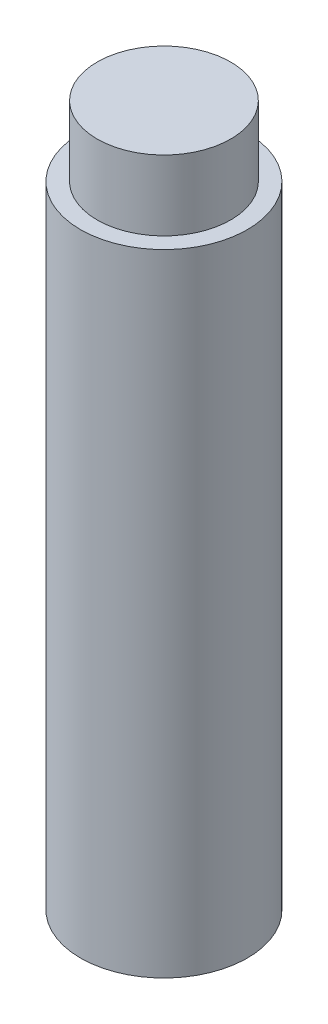
ISO-10303-21;
HEADER;
FILE_DESCRIPTION(('STEP AP214'),'2;1');
FILE_NAME('part.step','',(''),(''),'','','');
FILE_SCHEMA(('AUTOMOTIVE_DESIGN { 1 0 10303 214 1 1 1 1 }'));
ENDSEC;
DATA;
#1=APPLICATION_CONTEXT('core data for automotive mechanical design processes');
#2=APPLICATION_PROTOCOL_DEFINITION('international standard','automotive_design',2000,#1);
#3=PRODUCT_CONTEXT('',#1,'mechanical');
#4=PRODUCT('Part','Part','',(#3));
#5=PRODUCT_RELATED_PRODUCT_CATEGORY('part','',(#4));
#6=PRODUCT_DEFINITION_FORMATION('','',#4);
#7=PRODUCT_DEFINITION_CONTEXT('part definition',#1,'design');
#8=PRODUCT_DEFINITION('design','',#6,#7);
#9=PRODUCT_DEFINITION_SHAPE('','',#8);
#10=(LENGTH_UNIT() NAMED_UNIT(*) SI_UNIT(.MILLI.,.METRE.));
#11=(NAMED_UNIT(*) PLANE_ANGLE_UNIT() SI_UNIT($,.RADIAN.));
#12=(NAMED_UNIT(*) SI_UNIT($,.STERADIAN.) SOLID_ANGLE_UNIT());
#13=UNCERTAINTY_MEASURE_WITH_UNIT(LENGTH_MEASURE(1.E-05),#10,'distance_accuracy_value','');
#14=(GEOMETRIC_REPRESENTATION_CONTEXT(3) GLOBAL_UNCERTAINTY_ASSIGNED_CONTEXT((#13)) GLOBAL_UNIT_ASSIGNED_CONTEXT((#10,
#11,#12)) REPRESENTATION_CONTEXT('',''));
#15=CARTESIAN_POINT('',(0.,0.,0.));
#16=DIRECTION('',(0.,0.,1.));
#17=DIRECTION('',(1.,0.,0.));
#18=AXIS2_PLACEMENT_3D('',#15,#16,#17);
#19=CARTESIAN_POINT('',(0.,20.,0.));
#20=DIRECTION('',(0.,-1.,0.));
#21=DIRECTION('',(0.,0.,-1.));
#22=AXIS2_PLACEMENT_3D('',#19,#20,#21);
#23=CYLINDRICAL_SURFACE('',#22,2.38125);
#24=CARTESIAN_POINT('',(0.,0.,0.));
#25=DIRECTION('',(0.,1.,0.));
#26=DIRECTION('',(0.,0.,1.));
#27=AXIS2_PLACEMENT_3D('',#24,#25,#26);
#28=CIRCLE('',#27,2.38125);
#29=CARTESIAN_POINT('',(0.,0.,2.38125));
#30=VERTEX_POINT('',#29);
#31=EDGE_CURVE('E10',#30,#30,#28,.T.);
#32=ORIENTED_EDGE('',*,*,#31,.T.);
#33=EDGE_LOOP('',(#32));
#34=FACE_BOUND('',#33,.T.);
#35=CARTESIAN_POINT('',(0.,18.,0.));
#36=DIRECTION('',(0.,1.,0.));
#37=DIRECTION('',(0.,0.,1.));
#38=AXIS2_PLACEMENT_3D('',#35,#36,#37);
#39=CIRCLE('',#38,2.38125);
#40=CARTESIAN_POINT('',(0.,18.,2.38125));
#41=VERTEX_POINT('',#40);
#42=EDGE_CURVE('E37',#41,#41,#39,.T.);
#43=ORIENTED_EDGE('',*,*,#42,.F.);
#44=EDGE_LOOP('',(#43));
#45=FACE_BOUND('',#44,.T.);
#46=ADVANCED_FACE('F31',(#34,#45),#23,.T.);
#47=CARTESIAN_POINT('',(0.,0.,0.));
#48=DIRECTION('',(0.,1.,0.));
#49=DIRECTION('',(0.,0.,1.));
#50=AXIS2_PLACEMENT_3D('',#47,#48,#49);
#51=PLANE('',#50);
#52=ORIENTED_EDGE('',*,*,#31,.F.);
#53=EDGE_LOOP('',(#52));
#54=FACE_BOUND('',#53,.T.);
#55=ADVANCED_FACE('F63',(#54),#51,.F.);
#56=CARTESIAN_POINT('',(0.,18.,0.));
#57=DIRECTION('',(0.,1.,0.));
#58=DIRECTION('',(0.,0.,1.));
#59=AXIS2_PLACEMENT_3D('',#56,#57,#58);
#60=PLANE('',#59);
#61=CARTESIAN_POINT('',(0.,18.,0.));
#62=DIRECTION('',(0.,1.,0.));
#63=DIRECTION('',(0.,0.,1.));
#64=AXIS2_PLACEMENT_3D('',#61,#62,#63);
#65=CIRCLE('',#64,1.905);
#66=CARTESIAN_POINT('',(0.,18.,1.905));
#67=VERTEX_POINT('',#66);
#68=EDGE_CURVE('E41',#67,#67,#65,.T.);
#69=ORIENTED_EDGE('',*,*,#68,.F.);
#70=EDGE_LOOP('',(#69));
#71=FACE_BOUND('',#70,.T.);
#72=ORIENTED_EDGE('',*,*,#42,.T.);
#73=EDGE_LOOP('',(#72));
#74=FACE_BOUND('',#73,.T.);
#75=ADVANCED_FACE('F55',(#71,#74),#60,.T.);
#76=CARTESIAN_POINT('',(0.,18.,0.));
#77=DIRECTION('',(0.,1.,0.));
#78=DIRECTION('',(0.,0.,1.));
#79=AXIS2_PLACEMENT_3D('',#76,#77,#78);
#80=CYLINDRICAL_SURFACE('',#79,1.905);
#81=ORIENTED_EDGE('',*,*,#68,.T.);
#82=EDGE_LOOP('',(#81));
#83=FACE_BOUND('',#82,.T.);
#84=CARTESIAN_POINT('',(0.,20.,0.));
#85=DIRECTION('',(0.,1.,0.));
#86=DIRECTION('',(0.,0.,1.));
#87=AXIS2_PLACEMENT_3D('',#84,#85,#86);
#88=CIRCLE('',#87,1.905);
#89=CARTESIAN_POINT('',(0.,20.,1.905));
#90=VERTEX_POINT('',#89);
#91=EDGE_CURVE('E45',#90,#90,#88,.T.);
#92=ORIENTED_EDGE('',*,*,#91,.F.);
#93=EDGE_LOOP('',(#92));
#94=FACE_BOUND('',#93,.T.);
#95=ADVANCED_FACE('F53',(#83,#94),#80,.T.);
#96=CARTESIAN_POINT('',(0.,20.,0.));
#97=DIRECTION('',(0.,1.,0.));
#98=DIRECTION('',(0.,0.,1.));
#99=AXIS2_PLACEMENT_3D('',#96,#97,#98);
#100=PLANE('',#99);
#101=ORIENTED_EDGE('',*,*,#91,.T.);
#102=EDGE_LOOP('',(#101));
#103=FACE_BOUND('',#102,.T.);
#104=ADVANCED_FACE('F51',(#103),#100,.T.);
#105=CLOSED_SHELL('',(#46,#55,#75,#95,#104));
#106=MANIFOLD_SOLID_BREP('B2',#105);
#107=ADVANCED_BREP_SHAPE_REPRESENTATION('',(#18,#106),#14);
#108=SHAPE_DEFINITION_REPRESENTATION(#9,#107);
ENDSEC;
END-ISO-10303-21;
